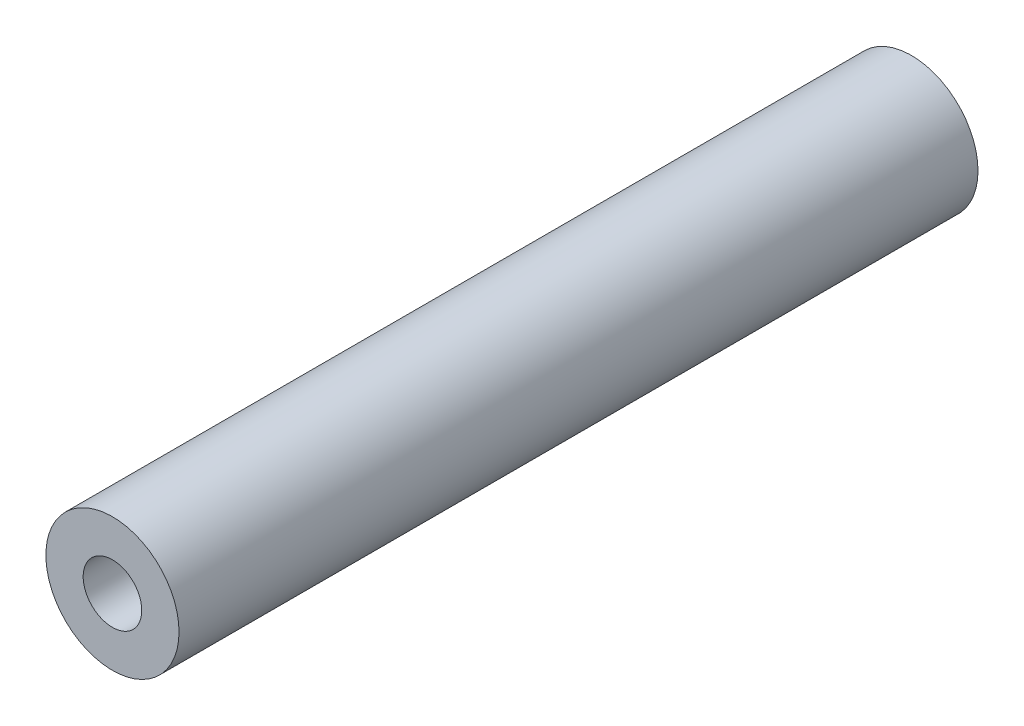
ISO-10303-21;
HEADER;
FILE_DESCRIPTION(('STEP AP214'),'2;1');
FILE_NAME('part.step','',(''),(''),'','','');
FILE_SCHEMA(('AUTOMOTIVE_DESIGN { 1 0 10303 214 1 1 1 1 }'));
ENDSEC;
DATA;
#1=APPLICATION_CONTEXT('core data for automotive mechanical design processes');
#2=APPLICATION_PROTOCOL_DEFINITION('international standard','automotive_design',2000,#1);
#3=PRODUCT_CONTEXT('',#1,'mechanical');
#4=PRODUCT('Part','Part','',(#3));
#5=PRODUCT_RELATED_PRODUCT_CATEGORY('part','',(#4));
#6=PRODUCT_DEFINITION_FORMATION('','',#4);
#7=PRODUCT_DEFINITION_CONTEXT('part definition',#1,'design');
#8=PRODUCT_DEFINITION('design','',#6,#7);
#9=PRODUCT_DEFINITION_SHAPE('','',#8);
#10=(LENGTH_UNIT() NAMED_UNIT(*) SI_UNIT(.MILLI.,.METRE.));
#11=(NAMED_UNIT(*) PLANE_ANGLE_UNIT() SI_UNIT($,.RADIAN.));
#12=(NAMED_UNIT(*) SI_UNIT($,.STERADIAN.) SOLID_ANGLE_UNIT());
#13=UNCERTAINTY_MEASURE_WITH_UNIT(LENGTH_MEASURE(1.E-05),#10,'distance_accuracy_value','');
#14=(GEOMETRIC_REPRESENTATION_CONTEXT(3) GLOBAL_UNCERTAINTY_ASSIGNED_CONTEXT((#13)) GLOBAL_UNIT_ASSIGNED_CONTEXT((#10,
#11,#12)) REPRESENTATION_CONTEXT('',''));
#15=CARTESIAN_POINT('',(0.,0.,0.));
#16=DIRECTION('',(0.,0.,1.));
#17=DIRECTION('',(1.,0.,0.));
#18=AXIS2_PLACEMENT_3D('',#15,#16,#17);
#19=CARTESIAN_POINT('',(0.,0.,38.1));
#20=DIRECTION('',(0.,0.,-1.));
#21=DIRECTION('',(-1.,0.,0.));
#22=AXIS2_PLACEMENT_3D('',#19,#20,#21);
#23=CYLINDRICAL_SURFACE('',#22,3.175);
#24=CARTESIAN_POINT('',(0.,0.,38.1));
#25=DIRECTION('',(0.,0.,1.));
#26=DIRECTION('',(1.,0.,0.));
#27=AXIS2_PLACEMENT_3D('',#24,#25,#26);
#28=CIRCLE('',#27,3.175);
#29=CARTESIAN_POINT('',(3.175,0.,38.1));
#30=VERTEX_POINT('',#29);
#31=EDGE_CURVE('E10',#30,#30,#28,.T.);
#32=ORIENTED_EDGE('',*,*,#31,.F.);
#33=EDGE_LOOP('',(#32));
#34=FACE_BOUND('',#33,.T.);
#35=CARTESIAN_POINT('',(0.,0.,0.));
#36=DIRECTION('',(0.,0.,1.));
#37=DIRECTION('',(1.,0.,0.));
#38=AXIS2_PLACEMENT_3D('',#35,#36,#37);
#39=CIRCLE('',#38,3.175);
#40=CARTESIAN_POINT('',(3.175,0.,0.));
#41=VERTEX_POINT('',#40);
#42=EDGE_CURVE('E39',#41,#41,#39,.T.);
#43=ORIENTED_EDGE('',*,*,#42,.T.);
#44=EDGE_LOOP('',(#43));
#45=FACE_BOUND('',#44,.T.);
#46=ADVANCED_FACE('F36',(#34,#45),#23,.T.);
#47=CARTESIAN_POINT('',(0.,0.,38.1));
#48=DIRECTION('',(0.,0.,1.));
#49=DIRECTION('',(1.,0.,0.));
#50=AXIS2_PLACEMENT_3D('',#47,#48,#49);
#51=PLANE('',#50);
#52=CARTESIAN_POINT('',(0.,0.,38.1));
#53=DIRECTION('',(0.,0.,1.));
#54=DIRECTION('',(1.,0.,0.));
#55=AXIS2_PLACEMENT_3D('',#52,#53,#54);
#56=CIRCLE('',#55,1.397);
#57=CARTESIAN_POINT('',(1.397,0.,38.1));
#58=VERTEX_POINT('',#57);
#59=EDGE_CURVE('E48',#58,#58,#56,.T.);
#60=ORIENTED_EDGE('',*,*,#59,.F.);
#61=EDGE_LOOP('',(#60));
#62=FACE_BOUND('',#61,.T.);
#63=ORIENTED_EDGE('',*,*,#31,.T.);
#64=EDGE_LOOP('',(#63));
#65=FACE_BOUND('',#64,.T.);
#66=ADVANCED_FACE('F63',(#62,#65),#51,.T.);
#67=CARTESIAN_POINT('',(0.,0.,0.));
#68=DIRECTION('',(0.,0.,1.));
#69=DIRECTION('',(1.,0.,0.));
#70=AXIS2_PLACEMENT_3D('',#67,#68,#69);
#71=PLANE('',#70);
#72=ORIENTED_EDGE('',*,*,#42,.F.);
#73=EDGE_LOOP('',(#72));
#74=FACE_BOUND('',#73,.T.);
#75=ADVANCED_FACE('F59',(#74),#71,.F.);
#76=CARTESIAN_POINT('',(0.,0.,33.02));
#77=DIRECTION('',(0.,0.,1.));
#78=DIRECTION('',(1.,0.,0.));
#79=AXIS2_PLACEMENT_3D('',#76,#77,#78);
#80=CYLINDRICAL_SURFACE('',#79,1.397);
#81=CARTESIAN_POINT('',(0.,0.,33.02));
#82=DIRECTION('',(0.,0.,1.));
#83=DIRECTION('',(1.,0.,0.));
#84=AXIS2_PLACEMENT_3D('',#81,#82,#83);
#85=CIRCLE('',#84,1.397);
#86=CARTESIAN_POINT('',(1.397,0.,33.02));
#87=VERTEX_POINT('',#86);
#88=EDGE_CURVE('E46',#87,#87,#85,.T.);
#89=ORIENTED_EDGE('',*,*,#88,.F.);
#90=EDGE_LOOP('',(#89));
#91=FACE_BOUND('',#90,.T.);
#92=ORIENTED_EDGE('',*,*,#59,.T.);
#93=EDGE_LOOP('',(#92));
#94=FACE_BOUND('',#93,.T.);
#95=ADVANCED_FACE('F56',(#91,#94),#80,.F.);
#96=CARTESIAN_POINT('',(0.,0.,33.02));
#97=DIRECTION('',(0.,0.,1.));
#98=DIRECTION('',(1.,0.,0.));
#99=AXIS2_PLACEMENT_3D('',#96,#97,#98);
#100=PLANE('',#99);
#101=ORIENTED_EDGE('',*,*,#88,.T.);
#102=EDGE_LOOP('',(#101));
#103=FACE_BOUND('',#102,.T.);
#104=ADVANCED_FACE('F54',(#103),#100,.T.);
#105=CLOSED_SHELL('',(#46,#66,#75,#95,#104));
#106=MANIFOLD_SOLID_BREP('B2',#105);
#107=ADVANCED_BREP_SHAPE_REPRESENTATION('',(#18,#106),#14);
#108=SHAPE_DEFINITION_REPRESENTATION(#9,#107);
ENDSEC;
END-ISO-10303-21;
